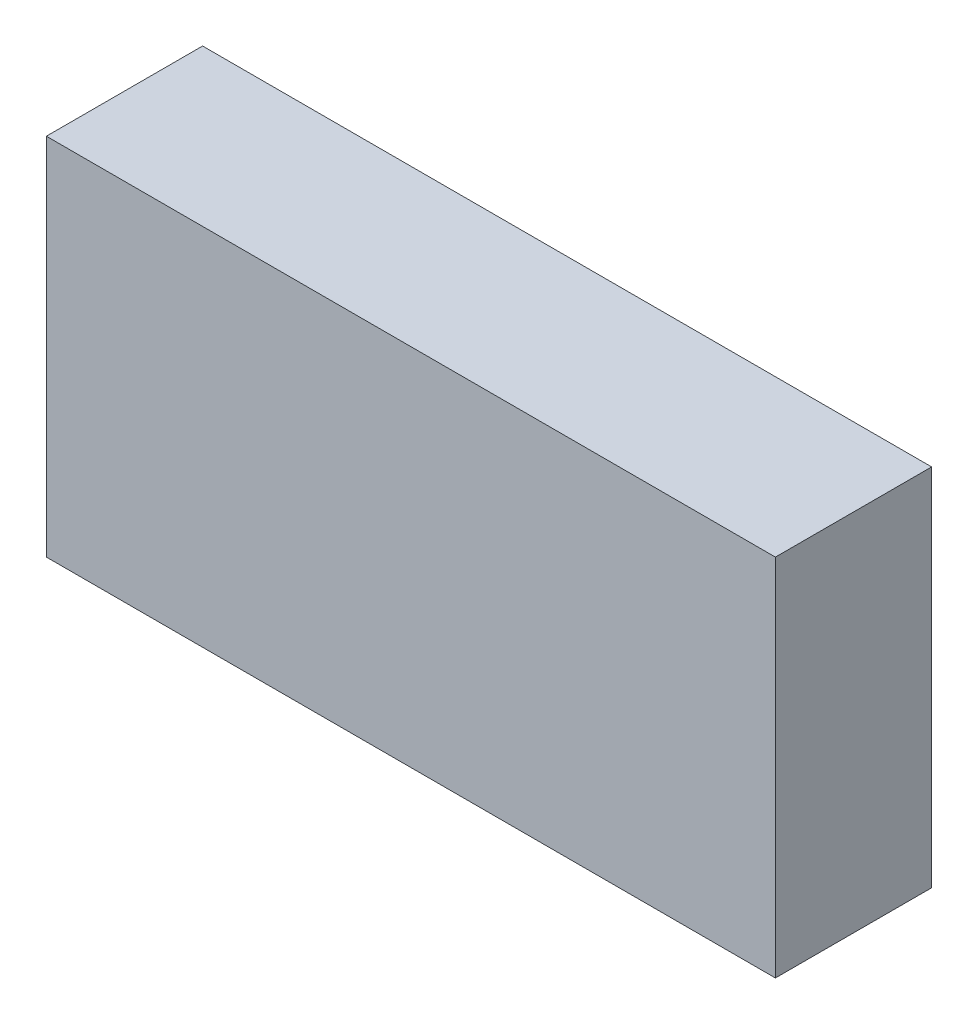
ISO-10303-21;
HEADER;
FILE_DESCRIPTION(('STEP AP214'),'2;1');
FILE_NAME('part.step','',(''),(''),'','','');
FILE_SCHEMA(('AUTOMOTIVE_DESIGN { 1 0 10303 214 1 1 1 1 }'));
ENDSEC;
DATA;
#1=APPLICATION_CONTEXT('core data for automotive mechanical design processes');
#2=APPLICATION_PROTOCOL_DEFINITION('international standard','automotive_design',2000,#1);
#3=PRODUCT_CONTEXT('',#1,'mechanical');
#4=PRODUCT('Part','Part','',(#3));
#5=PRODUCT_RELATED_PRODUCT_CATEGORY('part','',(#4));
#6=PRODUCT_DEFINITION_FORMATION('','',#4);
#7=PRODUCT_DEFINITION_CONTEXT('part definition',#1,'design');
#8=PRODUCT_DEFINITION('design','',#6,#7);
#9=PRODUCT_DEFINITION_SHAPE('','',#8);
#10=(LENGTH_UNIT() NAMED_UNIT(*) SI_UNIT(.MILLI.,.METRE.));
#11=(NAMED_UNIT(*) PLANE_ANGLE_UNIT() SI_UNIT($,.RADIAN.));
#12=(NAMED_UNIT(*) SI_UNIT($,.STERADIAN.) SOLID_ANGLE_UNIT());
#13=UNCERTAINTY_MEASURE_WITH_UNIT(LENGTH_MEASURE(1.E-05),#10,'distance_accuracy_value','');
#14=(GEOMETRIC_REPRESENTATION_CONTEXT(3) GLOBAL_UNCERTAINTY_ASSIGNED_CONTEXT((#13)) GLOBAL_UNIT_ASSIGNED_CONTEXT((#10,
#11,#12)) REPRESENTATION_CONTEXT('',''));
#15=CARTESIAN_POINT('',(0.,0.,0.));
#16=DIRECTION('',(0.,0.,1.));
#17=DIRECTION('',(1.,0.,0.));
#18=AXIS2_PLACEMENT_3D('',#15,#16,#17);
#19=CARTESIAN_POINT('',(88.9,44.45,38.1));
#20=DIRECTION('',(-1.,0.,0.));
#21=DIRECTION('',(0.,0.,1.));
#22=AXIS2_PLACEMENT_3D('',#19,#20,#21);
#23=PLANE('',#22);
#24=DIRECTION('',(0.,1.,0.));
#25=VECTOR('',#24,1.);
#26=CARTESIAN_POINT('',(88.9,44.45,0.));
#27=LINE('',#26,#25);
#28=CARTESIAN_POINT('',(88.9,-44.45,0.));
#29=VERTEX_POINT('',#28);
#30=CARTESIAN_POINT('',(88.9,44.45,0.));
#31=VERTEX_POINT('',#30);
#32=EDGE_CURVE('E96',#29,#31,#27,.T.);
#33=ORIENTED_EDGE('',*,*,#32,.T.);
#34=DIRECTION('',(0.,0.,-1.));
#35=VECTOR('',#34,1.);
#36=CARTESIAN_POINT('',(88.9,44.45,38.1));
#37=LINE('',#36,#35);
#38=CARTESIAN_POINT('',(88.9,44.45,38.1));
#39=VERTEX_POINT('',#38);
#40=EDGE_CURVE('E11',#39,#31,#37,.T.);
#41=ORIENTED_EDGE('',*,*,#40,.F.);
#42=DIRECTION('',(0.,1.,0.));
#43=VECTOR('',#42,1.);
#44=CARTESIAN_POINT('',(88.9,44.45,38.1));
#45=LINE('',#44,#43);
#46=CARTESIAN_POINT('',(88.9,-44.45,38.1));
#47=VERTEX_POINT('',#46);
#48=EDGE_CURVE('E84',#47,#39,#45,.T.);
#49=ORIENTED_EDGE('',*,*,#48,.F.);
#50=DIRECTION('',(0.,0.,-1.));
#51=VECTOR('',#50,1.);
#52=CARTESIAN_POINT('',(88.9,-44.45,38.1));
#53=LINE('',#52,#51);
#54=EDGE_CURVE('E92',#47,#29,#53,.T.);
#55=ORIENTED_EDGE('',*,*,#54,.T.);
#56=EDGE_LOOP('',(#33,#41,#49,#55));
#57=FACE_BOUND('',#56,.T.);
#58=ADVANCED_FACE('F33',(#57),#23,.F.);
#59=CARTESIAN_POINT('',(-88.9,44.45,38.1));
#60=DIRECTION('',(0.,-1.,0.));
#61=DIRECTION('',(0.,0.,-1.));
#62=AXIS2_PLACEMENT_3D('',#59,#60,#61);
#63=PLANE('',#62);
#64=DIRECTION('',(-1.,0.,0.));
#65=VECTOR('',#64,1.);
#66=CARTESIAN_POINT('',(-88.9,44.45,0.));
#67=LINE('',#66,#65);
#68=CARTESIAN_POINT('',(-88.9,44.45,0.));
#69=VERTEX_POINT('',#68);
#70=EDGE_CURVE('E88',#31,#69,#67,.T.);
#71=ORIENTED_EDGE('',*,*,#70,.T.);
#72=DIRECTION('',(0.,0.,-1.));
#73=VECTOR('',#72,1.);
#74=CARTESIAN_POINT('',(-88.9,44.45,38.1));
#75=LINE('',#74,#73);
#76=CARTESIAN_POINT('',(-88.9,44.45,38.1));
#77=VERTEX_POINT('',#76);
#78=EDGE_CURVE('E41',#77,#69,#75,.T.);
#79=ORIENTED_EDGE('',*,*,#78,.F.);
#80=DIRECTION('',(-1.,0.,0.));
#81=VECTOR('',#80,1.);
#82=CARTESIAN_POINT('',(-88.9,44.45,38.1));
#83=LINE('',#82,#81);
#84=EDGE_CURVE('E79',#39,#77,#83,.T.);
#85=ORIENTED_EDGE('',*,*,#84,.F.);
#86=ORIENTED_EDGE('',*,*,#40,.T.);
#87=EDGE_LOOP('',(#71,#79,#85,#86));
#88=FACE_BOUND('',#87,.T.);
#89=ADVANCED_FACE('F87',(#88),#63,.F.);
#90=CARTESIAN_POINT('',(-88.9,44.45,38.1));
#91=DIRECTION('',(1.,0.,0.));
#92=DIRECTION('',(0.,0.,-1.));
#93=AXIS2_PLACEMENT_3D('',#90,#91,#92);
#94=PLANE('',#93);
#95=DIRECTION('',(0.,-1.,0.));
#96=VECTOR('',#95,1.);
#97=CARTESIAN_POINT('',(-88.9,44.45,0.));
#98=LINE('',#97,#96);
#99=CARTESIAN_POINT('',(-88.9,-44.45,0.));
#100=VERTEX_POINT('',#99);
#101=EDGE_CURVE('E66',#69,#100,#98,.T.);
#102=ORIENTED_EDGE('',*,*,#101,.T.);
#103=DIRECTION('',(0.,0.,-1.));
#104=VECTOR('',#103,1.);
#105=CARTESIAN_POINT('',(-88.9,-44.45,38.1));
#106=LINE('',#105,#104);
#107=CARTESIAN_POINT('',(-88.9,-44.45,38.1));
#108=VERTEX_POINT('',#107);
#109=EDGE_CURVE('E89',#108,#100,#106,.T.);
#110=ORIENTED_EDGE('',*,*,#109,.F.);
#111=DIRECTION('',(0.,-1.,0.));
#112=VECTOR('',#111,1.);
#113=CARTESIAN_POINT('',(-88.9,44.45,38.1));
#114=LINE('',#113,#112);
#115=EDGE_CURVE('E82',#77,#108,#114,.T.);
#116=ORIENTED_EDGE('',*,*,#115,.F.);
#117=ORIENTED_EDGE('',*,*,#78,.T.);
#118=EDGE_LOOP('',(#102,#110,#116,#117));
#119=FACE_BOUND('',#118,.T.);
#120=ADVANCED_FACE('F90',(#119),#94,.F.);
#121=CARTESIAN_POINT('',(-88.9,-44.45,38.1));
#122=DIRECTION('',(0.,1.,0.));
#123=DIRECTION('',(0.,0.,1.));
#124=AXIS2_PLACEMENT_3D('',#121,#122,#123);
#125=PLANE('',#124);
#126=DIRECTION('',(1.,0.,0.));
#127=VECTOR('',#126,1.);
#128=CARTESIAN_POINT('',(-88.9,-44.45,0.));
#129=LINE('',#128,#127);
#130=EDGE_CURVE('E72',#100,#29,#129,.T.);
#131=ORIENTED_EDGE('',*,*,#130,.T.);
#132=ORIENTED_EDGE('',*,*,#54,.F.);
#133=DIRECTION('',(1.,0.,0.));
#134=VECTOR('',#133,1.);
#135=CARTESIAN_POINT('',(-88.9,-44.45,38.1));
#136=LINE('',#135,#134);
#137=EDGE_CURVE('E49',#108,#47,#136,.T.);
#138=ORIENTED_EDGE('',*,*,#137,.F.);
#139=ORIENTED_EDGE('',*,*,#109,.T.);
#140=EDGE_LOOP('',(#131,#132,#138,#139));
#141=FACE_BOUND('',#140,.T.);
#142=ADVANCED_FACE('F103',(#141),#125,.F.);
#143=CARTESIAN_POINT('',(0.,0.,38.1));
#144=DIRECTION('',(0.,0.,1.));
#145=DIRECTION('',(1.,0.,0.));
#146=AXIS2_PLACEMENT_3D('',#143,#144,#145);
#147=PLANE('',#146);
#148=ORIENTED_EDGE('',*,*,#48,.T.);
#149=ORIENTED_EDGE('',*,*,#84,.T.);
#150=ORIENTED_EDGE('',*,*,#115,.T.);
#151=ORIENTED_EDGE('',*,*,#137,.T.);
#152=EDGE_LOOP('',(#148,#149,#150,#151));
#153=FACE_BOUND('',#152,.T.);
#154=ADVANCED_FACE('F80',(#153),#147,.T.);
#155=CARTESIAN_POINT('',(0.,0.,0.));
#156=DIRECTION('',(0.,0.,1.));
#157=DIRECTION('',(1.,0.,0.));
#158=AXIS2_PLACEMENT_3D('',#155,#156,#157);
#159=PLANE('',#158);
#160=ORIENTED_EDGE('',*,*,#32,.F.);
#161=ORIENTED_EDGE('',*,*,#130,.F.);
#162=ORIENTED_EDGE('',*,*,#101,.F.);
#163=ORIENTED_EDGE('',*,*,#70,.F.);
#164=EDGE_LOOP('',(#160,#161,#162,#163));
#165=FACE_BOUND('',#164,.T.);
#166=ADVANCED_FACE('F106',(#165),#159,.F.);
#167=CLOSED_SHELL('',(#58,#89,#120,#142,#154,#166));
#168=MANIFOLD_SOLID_BREP('B2',#167);
#169=ADVANCED_BREP_SHAPE_REPRESENTATION('',(#18,#168),#14);
#170=SHAPE_DEFINITION_REPRESENTATION(#9,#169);
ENDSEC;
END-ISO-10303-21;
